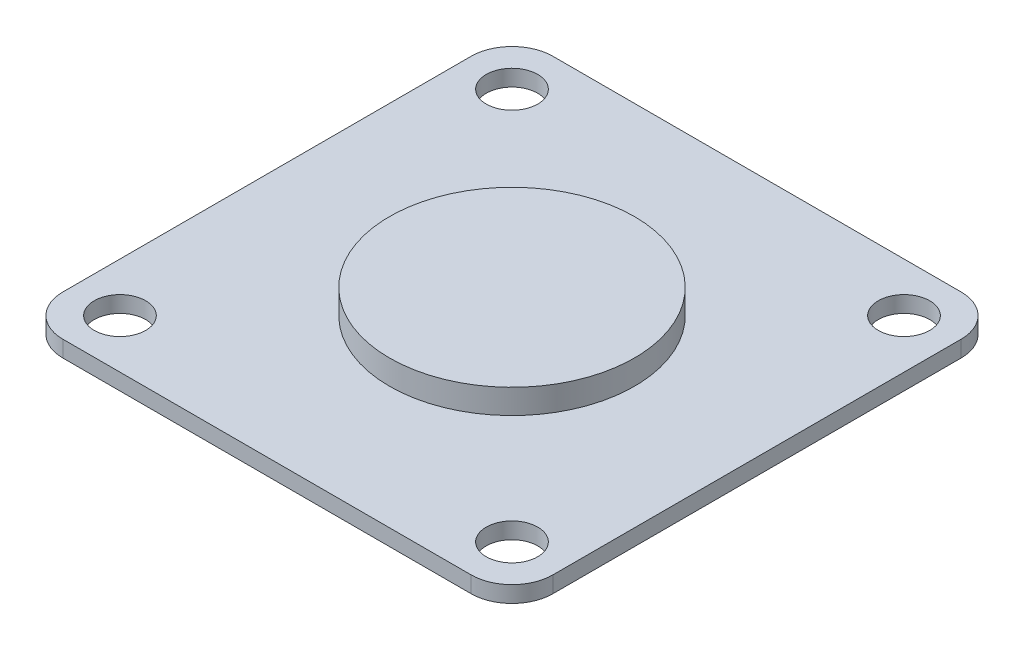
ISO-10303-21;
HEADER;
FILE_DESCRIPTION(('STEP AP214'),'2;1');
FILE_NAME('part.step','',(''),(''),'','','');
FILE_SCHEMA(('AUTOMOTIVE_DESIGN { 1 0 10303 214 1 1 1 1 }'));
ENDSEC;
DATA;
#1=APPLICATION_CONTEXT('core data for automotive mechanical design processes');
#2=APPLICATION_PROTOCOL_DEFINITION('international standard','automotive_design',2000,#1);
#3=PRODUCT_CONTEXT('',#1,'mechanical');
#4=PRODUCT('Part','Part','',(#3));
#5=PRODUCT_RELATED_PRODUCT_CATEGORY('part','',(#4));
#6=PRODUCT_DEFINITION_FORMATION('','',#4);
#7=PRODUCT_DEFINITION_CONTEXT('part definition',#1,'design');
#8=PRODUCT_DEFINITION('design','',#6,#7);
#9=PRODUCT_DEFINITION_SHAPE('','',#8);
#10=(LENGTH_UNIT() NAMED_UNIT(*) SI_UNIT(.MILLI.,.METRE.));
#11=(NAMED_UNIT(*) PLANE_ANGLE_UNIT() SI_UNIT($,.RADIAN.));
#12=(NAMED_UNIT(*) SI_UNIT($,.STERADIAN.) SOLID_ANGLE_UNIT());
#13=UNCERTAINTY_MEASURE_WITH_UNIT(LENGTH_MEASURE(1.E-05),#10,'distance_accuracy_value','');
#14=(GEOMETRIC_REPRESENTATION_CONTEXT(3) GLOBAL_UNCERTAINTY_ASSIGNED_CONTEXT((#13)) GLOBAL_UNIT_ASSIGNED_CONTEXT((#10,
#11,#12)) REPRESENTATION_CONTEXT('',''));
#15=CARTESIAN_POINT('',(0.,0.,0.));
#16=DIRECTION('',(0.,0.,1.));
#17=DIRECTION('',(1.,0.,0.));
#18=AXIS2_PLACEMENT_3D('',#15,#16,#17);
#19=CARTESIAN_POINT('',(25.,2.,-25.));
#20=DIRECTION('',(0.,-1.,0.));
#21=DIRECTION('',(0.,0.,-1.));
#22=AXIS2_PLACEMENT_3D('',#19,#20,#21);
#23=PLANE('',#22);
#24=CARTESIAN_POINT('',(0.,2.,0.));
#25=DIRECTION('',(0.,-1.,0.));
#26=DIRECTION('',(0.,0.,-1.));
#27=AXIS2_PLACEMENT_3D('',#24,#25,#26);
#28=CIRCLE('',#27,15.);
#29=CARTESIAN_POINT('',(0.,2.,-15.));
#30=VERTEX_POINT('',#29);
#31=EDGE_CURVE('E11',#30,#30,#28,.F.);
#32=ORIENTED_EDGE('',*,*,#31,.F.);
#33=EDGE_LOOP('',(#32));
#34=FACE_BOUND('',#33,.T.);
#35=CARTESIAN_POINT('',(25.,2.,-25.));
#36=DIRECTION('',(0.,1.,0.));
#37=DIRECTION('',(0.,0.,-1.));
#38=AXIS2_PLACEMENT_3D('',#35,#36,#37);
#39=CIRCLE('',#38,5.);
#40=CARTESIAN_POINT('',(30.,2.,-25.));
#41=VERTEX_POINT('',#40);
#42=CARTESIAN_POINT('',(25.,2.,-30.));
#43=VERTEX_POINT('',#42);
#44=EDGE_CURVE('E149',#41,#43,#39,.T.);
#45=ORIENTED_EDGE('',*,*,#44,.T.);
#46=DIRECTION('',(-1.,0.,0.));
#47=VECTOR('',#46,1.);
#48=CARTESIAN_POINT('',(-25.,2.,-30.));
#49=LINE('',#48,#47);
#50=CARTESIAN_POINT('',(-25.,2.,-30.));
#51=VERTEX_POINT('',#50);
#52=EDGE_CURVE('E97',#43,#51,#49,.T.);
#53=ORIENTED_EDGE('',*,*,#52,.T.);
#54=CARTESIAN_POINT('',(-25.,2.,-25.));
#55=DIRECTION('',(0.,1.,0.));
#56=DIRECTION('',(0.,0.,-1.));
#57=AXIS2_PLACEMENT_3D('',#54,#55,#56);
#58=CIRCLE('',#57,5.);
#59=CARTESIAN_POINT('',(-30.,2.,-25.));
#60=VERTEX_POINT('',#59);
#61=EDGE_CURVE('E181',#51,#60,#58,.T.);
#62=ORIENTED_EDGE('',*,*,#61,.T.);
#63=DIRECTION('',(0.,0.,1.));
#64=VECTOR('',#63,1.);
#65=CARTESIAN_POINT('',(-30.,2.,25.));
#66=LINE('',#65,#64);
#67=CARTESIAN_POINT('',(-30.,2.,25.));
#68=VERTEX_POINT('',#67);
#69=EDGE_CURVE('E180',#60,#68,#66,.T.);
#70=ORIENTED_EDGE('',*,*,#69,.T.);
#71=CARTESIAN_POINT('',(-25.,2.,25.));
#72=DIRECTION('',(0.,1.,0.));
#73=DIRECTION('',(0.,0.,-1.));
#74=AXIS2_PLACEMENT_3D('',#71,#72,#73);
#75=CIRCLE('',#74,5.);
#76=CARTESIAN_POINT('',(-25.,2.,30.));
#77=VERTEX_POINT('',#76);
#78=EDGE_CURVE('E116',#68,#77,#75,.T.);
#79=ORIENTED_EDGE('',*,*,#78,.T.);
#80=DIRECTION('',(1.,0.,0.));
#81=VECTOR('',#80,1.);
#82=CARTESIAN_POINT('',(-25.,2.,30.));
#83=LINE('',#82,#81);
#84=CARTESIAN_POINT('',(25.,2.,30.));
#85=VERTEX_POINT('',#84);
#86=EDGE_CURVE('E110',#77,#85,#83,.T.);
#87=ORIENTED_EDGE('',*,*,#86,.T.);
#88=CARTESIAN_POINT('',(25.,2.,25.));
#89=DIRECTION('',(0.,1.,0.));
#90=DIRECTION('',(0.,0.,-1.));
#91=AXIS2_PLACEMENT_3D('',#88,#89,#90);
#92=CIRCLE('',#91,5.);
#93=CARTESIAN_POINT('',(30.,2.,25.));
#94=VERTEX_POINT('',#93);
#95=EDGE_CURVE('E114',#85,#94,#92,.T.);
#96=ORIENTED_EDGE('',*,*,#95,.T.);
#97=DIRECTION('',(0.,0.,-1.));
#98=VECTOR('',#97,1.);
#99=CARTESIAN_POINT('',(30.,2.,25.));
#100=LINE('',#99,#98);
#101=EDGE_CURVE('E53',#94,#41,#100,.T.);
#102=ORIENTED_EDGE('',*,*,#101,.T.);
#103=EDGE_LOOP('',(#45,#53,#62,#70,#79,#87,#96,#102));
#104=FACE_BOUND('',#103,.T.);
#105=CARTESIAN_POINT('',(-24.,2.,-24.));
#106=DIRECTION('',(0.,1.,0.));
#107=DIRECTION('',(0.,0.,1.));
#108=AXIS2_PLACEMENT_3D('',#105,#106,#107);
#109=CIRCLE('',#108,3.15);
#110=CARTESIAN_POINT('',(-24.,2.,-20.85));
#111=VERTEX_POINT('',#110);
#112=EDGE_CURVE('E138',#111,#111,#109,.T.);
#113=ORIENTED_EDGE('',*,*,#112,.F.);
#114=EDGE_LOOP('',(#113));
#115=FACE_BOUND('',#114,.T.);
#116=CARTESIAN_POINT('',(24.,2.,-24.));
#117=DIRECTION('',(0.,1.,0.));
#118=DIRECTION('',(0.,0.,1.));
#119=AXIS2_PLACEMENT_3D('',#116,#117,#118);
#120=CIRCLE('',#119,3.15000000000011);
#121=CARTESIAN_POINT('',(24.,2.,-20.8499999999999));
#122=VERTEX_POINT('',#121);
#123=EDGE_CURVE('E190',#122,#122,#120,.T.);
#124=ORIENTED_EDGE('',*,*,#123,.F.);
#125=EDGE_LOOP('',(#124));
#126=FACE_BOUND('',#125,.T.);
#127=CARTESIAN_POINT('',(24.,2.,24.));
#128=DIRECTION('',(0.,1.,0.));
#129=DIRECTION('',(0.,0.,1.));
#130=AXIS2_PLACEMENT_3D('',#127,#128,#129);
#131=CIRCLE('',#130,3.15);
#132=CARTESIAN_POINT('',(24.,2.,27.15));
#133=VERTEX_POINT('',#132);
#134=EDGE_CURVE('E196',#133,#133,#131,.T.);
#135=ORIENTED_EDGE('',*,*,#134,.F.);
#136=EDGE_LOOP('',(#135));
#137=FACE_BOUND('',#136,.T.);
#138=CARTESIAN_POINT('',(-24.,2.,24.));
#139=DIRECTION('',(0.,1.,0.));
#140=DIRECTION('',(0.,0.,1.));
#141=AXIS2_PLACEMENT_3D('',#138,#139,#140);
#142=CIRCLE('',#141,3.15);
#143=CARTESIAN_POINT('',(-24.,2.,27.15));
#144=VERTEX_POINT('',#143);
#145=EDGE_CURVE('E202',#144,#144,#142,.T.);
#146=ORIENTED_EDGE('',*,*,#145,.F.);
#147=EDGE_LOOP('',(#146));
#148=FACE_BOUND('',#147,.T.);
#149=ADVANCED_FACE('F36',(#34,#104,#115,#126,#137,#148),#23,.F.);
#150=CARTESIAN_POINT('',(25.,0.,-25.));
#151=DIRECTION('',(0.,-1.,0.));
#152=DIRECTION('',(0.,0.,-1.));
#153=AXIS2_PLACEMENT_3D('',#150,#151,#152);
#154=PLANE('',#153);
#155=CARTESIAN_POINT('',(24.,0.,24.));
#156=DIRECTION('',(0.,1.,0.));
#157=DIRECTION('',(0.,0.,1.));
#158=AXIS2_PLACEMENT_3D('',#155,#156,#157);
#159=CIRCLE('',#158,3.15);
#160=CARTESIAN_POINT('',(24.,0.,27.15));
#161=VERTEX_POINT('',#160);
#162=EDGE_CURVE('E199',#161,#161,#159,.T.);
#163=ORIENTED_EDGE('',*,*,#162,.T.);
#164=EDGE_LOOP('',(#163));
#165=FACE_BOUND('',#164,.T.);
#166=CARTESIAN_POINT('',(-24.,0.,-24.));
#167=DIRECTION('',(0.,1.,0.));
#168=DIRECTION('',(0.,0.,1.));
#169=AXIS2_PLACEMENT_3D('',#166,#167,#168);
#170=CIRCLE('',#169,3.15);
#171=CARTESIAN_POINT('',(-24.,0.,-20.85));
#172=VERTEX_POINT('',#171);
#173=EDGE_CURVE('E187',#172,#172,#170,.T.);
#174=ORIENTED_EDGE('',*,*,#173,.T.);
#175=EDGE_LOOP('',(#174));
#176=FACE_BOUND('',#175,.T.);
#177=CARTESIAN_POINT('',(25.,0.,-25.));
#178=DIRECTION('',(0.,1.,0.));
#179=DIRECTION('',(0.,0.,-1.));
#180=AXIS2_PLACEMENT_3D('',#177,#178,#179);
#181=CIRCLE('',#180,5.);
#182=CARTESIAN_POINT('',(30.,0.,-25.));
#183=VERTEX_POINT('',#182);
#184=CARTESIAN_POINT('',(25.,0.,-30.));
#185=VERTEX_POINT('',#184);
#186=EDGE_CURVE('E134',#183,#185,#181,.T.);
#187=ORIENTED_EDGE('',*,*,#186,.F.);
#188=DIRECTION('',(0.,0.,-1.));
#189=VECTOR('',#188,1.);
#190=CARTESIAN_POINT('',(30.,0.,25.));
#191=LINE('',#190,#189);
#192=CARTESIAN_POINT('',(30.,0.,25.));
#193=VERTEX_POINT('',#192);
#194=EDGE_CURVE('E88',#193,#183,#191,.T.);
#195=ORIENTED_EDGE('',*,*,#194,.F.);
#196=CARTESIAN_POINT('',(25.,0.,25.));
#197=DIRECTION('',(0.,1.,0.));
#198=DIRECTION('',(0.,0.,-1.));
#199=AXIS2_PLACEMENT_3D('',#196,#197,#198);
#200=CIRCLE('',#199,5.);
#201=CARTESIAN_POINT('',(25.,0.,30.));
#202=VERTEX_POINT('',#201);
#203=EDGE_CURVE('E82',#202,#193,#200,.T.);
#204=ORIENTED_EDGE('',*,*,#203,.F.);
#205=DIRECTION('',(1.,0.,0.));
#206=VECTOR('',#205,1.);
#207=CARTESIAN_POINT('',(-25.,0.,30.));
#208=LINE('',#207,#206);
#209=CARTESIAN_POINT('',(-25.,0.,30.));
#210=VERTEX_POINT('',#209);
#211=EDGE_CURVE('E124',#210,#202,#208,.T.);
#212=ORIENTED_EDGE('',*,*,#211,.F.);
#213=CARTESIAN_POINT('',(-25.,0.,25.));
#214=DIRECTION('',(0.,1.,0.));
#215=DIRECTION('',(0.,0.,-1.));
#216=AXIS2_PLACEMENT_3D('',#213,#214,#215);
#217=CIRCLE('',#216,5.);
#218=CARTESIAN_POINT('',(-30.,0.,25.));
#219=VERTEX_POINT('',#218);
#220=EDGE_CURVE('E144',#219,#210,#217,.T.);
#221=ORIENTED_EDGE('',*,*,#220,.F.);
#222=DIRECTION('',(0.,0.,1.));
#223=VECTOR('',#222,1.);
#224=CARTESIAN_POINT('',(-30.,0.,25.));
#225=LINE('',#224,#223);
#226=CARTESIAN_POINT('',(-30.,0.,-25.));
#227=VERTEX_POINT('',#226);
#228=EDGE_CURVE('E142',#227,#219,#225,.T.);
#229=ORIENTED_EDGE('',*,*,#228,.F.);
#230=CARTESIAN_POINT('',(-25.,0.,-25.));
#231=DIRECTION('',(0.,1.,0.));
#232=DIRECTION('',(0.,0.,-1.));
#233=AXIS2_PLACEMENT_3D('',#230,#231,#232);
#234=CIRCLE('',#233,5.);
#235=CARTESIAN_POINT('',(-25.,0.,-30.));
#236=VERTEX_POINT('',#235);
#237=EDGE_CURVE('E140',#236,#227,#234,.T.);
#238=ORIENTED_EDGE('',*,*,#237,.F.);
#239=DIRECTION('',(-1.,0.,0.));
#240=VECTOR('',#239,1.);
#241=CARTESIAN_POINT('',(-25.,0.,-30.));
#242=LINE('',#241,#240);
#243=EDGE_CURVE('E137',#185,#236,#242,.T.);
#244=ORIENTED_EDGE('',*,*,#243,.F.);
#245=EDGE_LOOP('',(#187,#195,#204,#212,#221,#229,#238,#244));
#246=FACE_BOUND('',#245,.T.);
#247=CARTESIAN_POINT('',(24.,0.,-24.));
#248=DIRECTION('',(0.,1.,0.));
#249=DIRECTION('',(0.,0.,1.));
#250=AXIS2_PLACEMENT_3D('',#247,#248,#249);
#251=CIRCLE('',#250,3.15000000000011);
#252=CARTESIAN_POINT('',(24.,0.,-20.8499999999999));
#253=VERTEX_POINT('',#252);
#254=EDGE_CURVE('E193',#253,#253,#251,.T.);
#255=ORIENTED_EDGE('',*,*,#254,.T.);
#256=EDGE_LOOP('',(#255));
#257=FACE_BOUND('',#256,.T.);
#258=CARTESIAN_POINT('',(-24.,0.,24.));
#259=DIRECTION('',(0.,1.,0.));
#260=DIRECTION('',(0.,0.,1.));
#261=AXIS2_PLACEMENT_3D('',#258,#259,#260);
#262=CIRCLE('',#261,3.15);
#263=CARTESIAN_POINT('',(-24.,0.,27.15));
#264=VERTEX_POINT('',#263);
#265=EDGE_CURVE('E205',#264,#264,#262,.T.);
#266=ORIENTED_EDGE('',*,*,#265,.T.);
#267=EDGE_LOOP('',(#266));
#268=FACE_BOUND('',#267,.T.);
#269=ADVANCED_FACE('F167',(#165,#176,#246,#257,#268),#154,.T.);
#270=CARTESIAN_POINT('',(25.,2.,-25.));
#271=DIRECTION('',(0.,-1.,0.));
#272=DIRECTION('',(0.,0.,-1.));
#273=AXIS2_PLACEMENT_3D('',#270,#271,#272);
#274=CYLINDRICAL_SURFACE('',#273,5.);
#275=ORIENTED_EDGE('',*,*,#186,.T.);
#276=DIRECTION('',(0.,-1.,0.));
#277=VECTOR('',#276,1.);
#278=CARTESIAN_POINT('',(25.,2.,-30.));
#279=LINE('',#278,#277);
#280=EDGE_CURVE('E45',#43,#185,#279,.T.);
#281=ORIENTED_EDGE('',*,*,#280,.F.);
#282=ORIENTED_EDGE('',*,*,#44,.F.);
#283=DIRECTION('',(0.,-1.,0.));
#284=VECTOR('',#283,1.);
#285=CARTESIAN_POINT('',(30.,2.,-25.));
#286=LINE('',#285,#284);
#287=EDGE_CURVE('E130',#41,#183,#286,.T.);
#288=ORIENTED_EDGE('',*,*,#287,.T.);
#289=EDGE_LOOP('',(#275,#281,#282,#288));
#290=FACE_BOUND('',#289,.T.);
#291=ADVANCED_FACE('F38',(#290),#274,.T.);
#292=CARTESIAN_POINT('',(-25.,2.,-30.));
#293=DIRECTION('',(0.,0.,1.));
#294=DIRECTION('',(1.,0.,0.));
#295=AXIS2_PLACEMENT_3D('',#292,#293,#294);
#296=PLANE('',#295);
#297=ORIENTED_EDGE('',*,*,#243,.T.);
#298=DIRECTION('',(0.,-1.,0.));
#299=VECTOR('',#298,1.);
#300=CARTESIAN_POINT('',(-25.,2.,-30.));
#301=LINE('',#300,#299);
#302=EDGE_CURVE('E159',#51,#236,#301,.T.);
#303=ORIENTED_EDGE('',*,*,#302,.F.);
#304=ORIENTED_EDGE('',*,*,#52,.F.);
#305=ORIENTED_EDGE('',*,*,#280,.T.);
#306=EDGE_LOOP('',(#297,#303,#304,#305));
#307=FACE_BOUND('',#306,.T.);
#308=ADVANCED_FACE('F162',(#307),#296,.F.);
#309=CARTESIAN_POINT('',(-25.,2.,-25.));
#310=DIRECTION('',(0.,-1.,0.));
#311=DIRECTION('',(0.,0.,-1.));
#312=AXIS2_PLACEMENT_3D('',#309,#310,#311);
#313=CYLINDRICAL_SURFACE('',#312,5.);
#314=ORIENTED_EDGE('',*,*,#237,.T.);
#315=DIRECTION('',(0.,-1.,0.));
#316=VECTOR('',#315,1.);
#317=CARTESIAN_POINT('',(-30.,2.,-25.));
#318=LINE('',#317,#316);
#319=EDGE_CURVE('E156',#60,#227,#318,.T.);
#320=ORIENTED_EDGE('',*,*,#319,.F.);
#321=ORIENTED_EDGE('',*,*,#61,.F.);
#322=ORIENTED_EDGE('',*,*,#302,.T.);
#323=EDGE_LOOP('',(#314,#320,#321,#322));
#324=FACE_BOUND('',#323,.T.);
#325=ADVANCED_FACE('F174',(#324),#313,.T.);
#326=CARTESIAN_POINT('',(-30.,2.,25.));
#327=DIRECTION('',(1.,0.,0.));
#328=DIRECTION('',(0.,0.,-1.));
#329=AXIS2_PLACEMENT_3D('',#326,#327,#328);
#330=PLANE('',#329);
#331=ORIENTED_EDGE('',*,*,#228,.T.);
#332=DIRECTION('',(0.,-1.,0.));
#333=VECTOR('',#332,1.);
#334=CARTESIAN_POINT('',(-30.,2.,25.));
#335=LINE('',#334,#333);
#336=EDGE_CURVE('E153',#68,#219,#335,.T.);
#337=ORIENTED_EDGE('',*,*,#336,.F.);
#338=ORIENTED_EDGE('',*,*,#69,.F.);
#339=ORIENTED_EDGE('',*,*,#319,.T.);
#340=EDGE_LOOP('',(#331,#337,#338,#339));
#341=FACE_BOUND('',#340,.T.);
#342=ADVANCED_FACE('F178',(#341),#330,.F.);
#343=CARTESIAN_POINT('',(-25.,2.,25.));
#344=DIRECTION('',(0.,-1.,0.));
#345=DIRECTION('',(0.,0.,-1.));
#346=AXIS2_PLACEMENT_3D('',#343,#344,#345);
#347=CYLINDRICAL_SURFACE('',#346,5.);
#348=ORIENTED_EDGE('',*,*,#220,.T.);
#349=DIRECTION('',(0.,-1.,0.));
#350=VECTOR('',#349,1.);
#351=CARTESIAN_POINT('',(-25.,2.,30.));
#352=LINE('',#351,#350);
#353=EDGE_CURVE('E125',#77,#210,#352,.T.);
#354=ORIENTED_EDGE('',*,*,#353,.F.);
#355=ORIENTED_EDGE('',*,*,#78,.F.);
#356=ORIENTED_EDGE('',*,*,#336,.T.);
#357=EDGE_LOOP('',(#348,#354,#355,#356));
#358=FACE_BOUND('',#357,.T.);
#359=ADVANCED_FACE('F241',(#358),#347,.T.);
#360=CARTESIAN_POINT('',(-25.,2.,30.));
#361=DIRECTION('',(0.,0.,-1.));
#362=DIRECTION('',(-1.,0.,0.));
#363=AXIS2_PLACEMENT_3D('',#360,#361,#362);
#364=PLANE('',#363);
#365=ORIENTED_EDGE('',*,*,#211,.T.);
#366=DIRECTION('',(0.,-1.,0.));
#367=VECTOR('',#366,1.);
#368=CARTESIAN_POINT('',(25.,2.,30.));
#369=LINE('',#368,#367);
#370=EDGE_CURVE('E121',#85,#202,#369,.T.);
#371=ORIENTED_EDGE('',*,*,#370,.F.);
#372=ORIENTED_EDGE('',*,*,#86,.F.);
#373=ORIENTED_EDGE('',*,*,#353,.T.);
#374=EDGE_LOOP('',(#365,#371,#372,#373));
#375=FACE_BOUND('',#374,.T.);
#376=ADVANCED_FACE('F122',(#375),#364,.F.);
#377=CARTESIAN_POINT('',(25.,2.,25.));
#378=DIRECTION('',(0.,-1.,0.));
#379=DIRECTION('',(0.,0.,-1.));
#380=AXIS2_PLACEMENT_3D('',#377,#378,#379);
#381=CYLINDRICAL_SURFACE('',#380,5.);
#382=ORIENTED_EDGE('',*,*,#203,.T.);
#383=DIRECTION('',(0.,-1.,0.));
#384=VECTOR('',#383,1.);
#385=CARTESIAN_POINT('',(30.,2.,25.));
#386=LINE('',#385,#384);
#387=EDGE_CURVE('E126',#94,#193,#386,.T.);
#388=ORIENTED_EDGE('',*,*,#387,.F.);
#389=ORIENTED_EDGE('',*,*,#95,.F.);
#390=ORIENTED_EDGE('',*,*,#370,.T.);
#391=EDGE_LOOP('',(#382,#388,#389,#390));
#392=FACE_BOUND('',#391,.T.);
#393=ADVANCED_FACE('F128',(#392),#381,.T.);
#394=CARTESIAN_POINT('',(30.,2.,25.));
#395=DIRECTION('',(-1.,0.,0.));
#396=DIRECTION('',(0.,0.,1.));
#397=AXIS2_PLACEMENT_3D('',#394,#395,#396);
#398=PLANE('',#397);
#399=ORIENTED_EDGE('',*,*,#194,.T.);
#400=ORIENTED_EDGE('',*,*,#287,.F.);
#401=ORIENTED_EDGE('',*,*,#101,.F.);
#402=ORIENTED_EDGE('',*,*,#387,.T.);
#403=EDGE_LOOP('',(#399,#400,#401,#402));
#404=FACE_BOUND('',#403,.T.);
#405=ADVANCED_FACE('F234',(#404),#398,.F.);
#406=CARTESIAN_POINT('',(-24.,2.,-24.));
#407=DIRECTION('',(0.,-1.,0.));
#408=DIRECTION('',(0.,0.,-1.));
#409=AXIS2_PLACEMENT_3D('',#406,#407,#408);
#410=CYLINDRICAL_SURFACE('',#409,3.15);
#411=ORIENTED_EDGE('',*,*,#112,.T.);
#412=EDGE_LOOP('',(#411));
#413=FACE_BOUND('',#412,.T.);
#414=ORIENTED_EDGE('',*,*,#173,.F.);
#415=EDGE_LOOP('',(#414));
#416=FACE_BOUND('',#415,.T.);
#417=ADVANCED_FACE('F231',(#413,#416),#410,.F.);
#418=CARTESIAN_POINT('',(24.,2.,-24.));
#419=DIRECTION('',(0.,-1.,0.));
#420=DIRECTION('',(0.,0.,-1.));
#421=AXIS2_PLACEMENT_3D('',#418,#419,#420);
#422=CYLINDRICAL_SURFACE('',#421,3.15000000000011);
#423=ORIENTED_EDGE('',*,*,#123,.T.);
#424=EDGE_LOOP('',(#423));
#425=FACE_BOUND('',#424,.T.);
#426=ORIENTED_EDGE('',*,*,#254,.F.);
#427=EDGE_LOOP('',(#426));
#428=FACE_BOUND('',#427,.T.);
#429=ADVANCED_FACE('F307',(#425,#428),#422,.F.);
#430=CARTESIAN_POINT('',(24.,2.,24.));
#431=DIRECTION('',(0.,-1.,0.));
#432=DIRECTION('',(0.,0.,-1.));
#433=AXIS2_PLACEMENT_3D('',#430,#431,#432);
#434=CYLINDRICAL_SURFACE('',#433,3.15);
#435=ORIENTED_EDGE('',*,*,#134,.T.);
#436=EDGE_LOOP('',(#435));
#437=FACE_BOUND('',#436,.T.);
#438=ORIENTED_EDGE('',*,*,#162,.F.);
#439=EDGE_LOOP('',(#438));
#440=FACE_BOUND('',#439,.T.);
#441=ADVANCED_FACE('F315',(#437,#440),#434,.F.);
#442=CARTESIAN_POINT('',(-24.,2.,24.));
#443=DIRECTION('',(0.,-1.,0.));
#444=DIRECTION('',(0.,0.,-1.));
#445=AXIS2_PLACEMENT_3D('',#442,#443,#444);
#446=CYLINDRICAL_SURFACE('',#445,3.15);
#447=ORIENTED_EDGE('',*,*,#145,.T.);
#448=EDGE_LOOP('',(#447));
#449=FACE_BOUND('',#448,.T.);
#450=ORIENTED_EDGE('',*,*,#265,.F.);
#451=EDGE_LOOP('',(#450));
#452=FACE_BOUND('',#451,.T.);
#453=ADVANCED_FACE('F219',(#449,#452),#446,.F.);
#454=CARTESIAN_POINT('',(0.,5.,0.));
#455=DIRECTION('',(0.,-1.,0.));
#456=DIRECTION('',(0.,0.,-1.));
#457=AXIS2_PLACEMENT_3D('',#454,#455,#456);
#458=CYLINDRICAL_SURFACE('',#457,15.);
#459=CARTESIAN_POINT('',(0.,5.,0.));
#460=DIRECTION('',(0.,1.,0.));
#461=DIRECTION('',(0.,0.,1.));
#462=AXIS2_PLACEMENT_3D('',#459,#460,#461);
#463=CIRCLE('',#462,15.);
#464=CARTESIAN_POINT('',(0.,5.,15.));
#465=VERTEX_POINT('',#464);
#466=EDGE_CURVE('E208',#465,#465,#463,.T.);
#467=ORIENTED_EDGE('',*,*,#466,.F.);
#468=EDGE_LOOP('',(#467));
#469=FACE_BOUND('',#468,.T.);
#470=ORIENTED_EDGE('',*,*,#31,.T.);
#471=EDGE_LOOP('',(#470));
#472=FACE_BOUND('',#471,.T.);
#473=ADVANCED_FACE('F216',(#469,#472),#458,.T.);
#474=CARTESIAN_POINT('',(0.,5.,0.));
#475=DIRECTION('',(0.,1.,0.));
#476=DIRECTION('',(0.,0.,1.));
#477=AXIS2_PLACEMENT_3D('',#474,#475,#476);
#478=PLANE('',#477);
#479=ORIENTED_EDGE('',*,*,#466,.T.);
#480=EDGE_LOOP('',(#479));
#481=FACE_BOUND('',#480,.T.);
#482=ADVANCED_FACE('F214',(#481),#478,.T.);
#483=CLOSED_SHELL('',(#149,#269,#291,#308,#325,#342,#359,#376,#393,#405,#417,#429,#441,#453,
#473,#482));
#484=MANIFOLD_SOLID_BREP('B2',#483);
#485=ADVANCED_BREP_SHAPE_REPRESENTATION('',(#18,#484),#14);
#486=SHAPE_DEFINITION_REPRESENTATION(#9,#485);
ENDSEC;
END-ISO-10303-21;
